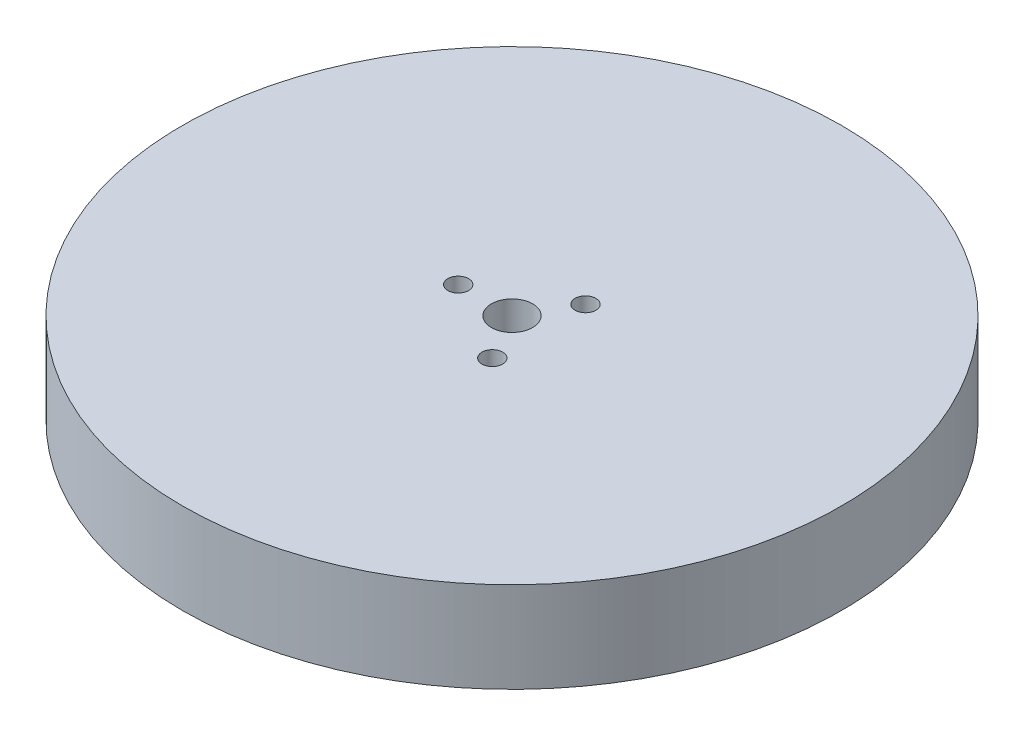
ISO-10303-21;
HEADER;
FILE_DESCRIPTION(('STEP AP214'),'2;1');
FILE_NAME('part.step','',(''),(''),'','','');
FILE_SCHEMA(('AUTOMOTIVE_DESIGN { 1 0 10303 214 1 1 1 1 }'));
ENDSEC;
DATA;
#1=APPLICATION_CONTEXT('core data for automotive mechanical design processes');
#2=APPLICATION_PROTOCOL_DEFINITION('international standard','automotive_design',2000,#1);
#3=PRODUCT_CONTEXT('',#1,'mechanical');
#4=PRODUCT('Part','Part','',(#3));
#5=PRODUCT_RELATED_PRODUCT_CATEGORY('part','',(#4));
#6=PRODUCT_DEFINITION_FORMATION('','',#4);
#7=PRODUCT_DEFINITION_CONTEXT('part definition',#1,'design');
#8=PRODUCT_DEFINITION('design','',#6,#7);
#9=PRODUCT_DEFINITION_SHAPE('','',#8);
#10=(LENGTH_UNIT() NAMED_UNIT(*) SI_UNIT(.MILLI.,.METRE.));
#11=(NAMED_UNIT(*) PLANE_ANGLE_UNIT() SI_UNIT($,.RADIAN.));
#12=(NAMED_UNIT(*) SI_UNIT($,.STERADIAN.) SOLID_ANGLE_UNIT());
#13=UNCERTAINTY_MEASURE_WITH_UNIT(LENGTH_MEASURE(1.E-05),#10,'distance_accuracy_value','');
#14=(GEOMETRIC_REPRESENTATION_CONTEXT(3) GLOBAL_UNCERTAINTY_ASSIGNED_CONTEXT((#13)) GLOBAL_UNIT_ASSIGNED_CONTEXT((#10,
#11,#12)) REPRESENTATION_CONTEXT('',''));
#15=CARTESIAN_POINT('',(0.,0.,0.));
#16=DIRECTION('',(0.,0.,1.));
#17=DIRECTION('',(1.,0.,0.));
#18=AXIS2_PLACEMENT_3D('',#15,#16,#17);
#19=CARTESIAN_POINT('',(0.,22.,0.));
#20=DIRECTION('',(0.,-1.,0.));
#21=DIRECTION('',(0.,0.,-1.));
#22=AXIS2_PLACEMENT_3D('',#19,#20,#21);
#23=CYLINDRICAL_SURFACE('',#22,80.);
#24=CARTESIAN_POINT('',(0.,22.,0.));
#25=DIRECTION('',(0.,1.,0.));
#26=DIRECTION('',(0.,0.,1.));
#27=AXIS2_PLACEMENT_3D('',#24,#25,#26);
#28=CIRCLE('',#27,80.);
#29=CARTESIAN_POINT('',(0.,22.,80.));
#30=VERTEX_POINT('',#29);
#31=EDGE_CURVE('E10',#30,#30,#28,.T.);
#32=ORIENTED_EDGE('',*,*,#31,.F.);
#33=EDGE_LOOP('',(#32));
#34=FACE_BOUND('',#33,.T.);
#35=CARTESIAN_POINT('',(0.,0.,0.));
#36=DIRECTION('',(0.,1.,0.));
#37=DIRECTION('',(0.,0.,1.));
#38=AXIS2_PLACEMENT_3D('',#35,#36,#37);
#39=CIRCLE('',#38,80.);
#40=CARTESIAN_POINT('',(0.,0.,80.));
#41=VERTEX_POINT('',#40);
#42=EDGE_CURVE('E37',#41,#41,#39,.T.);
#43=ORIENTED_EDGE('',*,*,#42,.T.);
#44=EDGE_LOOP('',(#43));
#45=FACE_BOUND('',#44,.T.);
#46=ADVANCED_FACE('F40',(#34,#45),#23,.T.);
#47=CARTESIAN_POINT('',(0.,22.,0.));
#48=DIRECTION('',(0.,1.,0.));
#49=DIRECTION('',(0.,0.,1.));
#50=AXIS2_PLACEMENT_3D('',#47,#48,#49);
#51=PLANE('',#50);
#52=CARTESIAN_POINT('',(6.52944692631327,22.,11.3093338216989));
#53=DIRECTION('',(0.,1.,0.));
#54=DIRECTION('',(0.866025403784436,0.,-0.500000000000004));
#55=AXIS2_PLACEMENT_3D('',#52,#53,#54);
#56=CIRCLE('',#55,2.52004237588757);
#57=CARTESIAN_POINT('',(8.71186764244519,22.,10.0493126337551));
#58=VERTEX_POINT('',#57);
#59=EDGE_CURVE('E70',#58,#58,#56,.T.);
#60=ORIENTED_EDGE('',*,*,#59,.F.);
#61=EDGE_LOOP('',(#60));
#62=FACE_BOUND('',#61,.T.);
#63=CARTESIAN_POINT('',(6.52944692631311,22.,-11.309333821699));
#64=DIRECTION('',(0.,1.,0.));
#65=DIRECTION('',(-0.866025403784443,0.,-0.499999999999992));
#66=AXIS2_PLACEMENT_3D('',#63,#64,#65);
#67=CIRCLE('',#66,2.52004237588757);
#68=CARTESIAN_POINT('',(4.34702621018117,22.,-12.5693550096428));
#69=VERTEX_POINT('',#68);
#70=EDGE_CURVE('E61',#69,#69,#67,.T.);
#71=ORIENTED_EDGE('',*,*,#70,.F.);
#72=EDGE_LOOP('',(#71));
#73=FACE_BOUND('',#72,.T.);
#74=CARTESIAN_POINT('',(-13.0588938526264,22.,0.));
#75=DIRECTION('',(0.,1.,0.));
#76=DIRECTION('',(0.,0.,1.));
#77=AXIS2_PLACEMENT_3D('',#74,#75,#76);
#78=CIRCLE('',#77,2.52004237588757);
#79=CARTESIAN_POINT('',(-13.0588938526264,22.,2.52004237588757));
#80=VERTEX_POINT('',#79);
#81=EDGE_CURVE('E54',#80,#80,#78,.T.);
#82=ORIENTED_EDGE('',*,*,#81,.F.);
#83=EDGE_LOOP('',(#82));
#84=FACE_BOUND('',#83,.T.);
#85=CARTESIAN_POINT('',(0.,22.,0.));
#86=DIRECTION('',(0.,1.,0.));
#87=DIRECTION('',(0.,0.,1.));
#88=AXIS2_PLACEMENT_3D('',#85,#86,#87);
#89=CIRCLE('',#88,5.);
#90=CARTESIAN_POINT('',(0.,22.,5.));
#91=VERTEX_POINT('',#90);
#92=EDGE_CURVE('E50',#91,#91,#89,.T.);
#93=ORIENTED_EDGE('',*,*,#92,.F.);
#94=EDGE_LOOP('',(#93));
#95=FACE_BOUND('',#94,.T.);
#96=ORIENTED_EDGE('',*,*,#31,.T.);
#97=EDGE_LOOP('',(#96));
#98=FACE_BOUND('',#97,.T.);
#99=ADVANCED_FACE('F85',(#62,#73,#84,#95,#98),#51,.T.);
#100=CARTESIAN_POINT('',(0.,0.,0.));
#101=DIRECTION('',(0.,1.,0.));
#102=DIRECTION('',(0.,0.,1.));
#103=AXIS2_PLACEMENT_3D('',#100,#101,#102);
#104=PLANE('',#103);
#105=CARTESIAN_POINT('',(0.,0.,0.));
#106=DIRECTION('',(0.,1.,0.));
#107=DIRECTION('',(0.,0.,1.));
#108=AXIS2_PLACEMENT_3D('',#105,#106,#107);
#109=CIRCLE('',#108,5.);
#110=CARTESIAN_POINT('',(0.,0.,5.));
#111=VERTEX_POINT('',#110);
#112=EDGE_CURVE('E47',#111,#111,#109,.T.);
#113=ORIENTED_EDGE('',*,*,#112,.T.);
#114=EDGE_LOOP('',(#113));
#115=FACE_BOUND('',#114,.T.);
#116=ORIENTED_EDGE('',*,*,#42,.F.);
#117=EDGE_LOOP('',(#116));
#118=FACE_BOUND('',#117,.T.);
#119=ADVANCED_FACE('F84',(#115,#118),#104,.F.);
#120=CARTESIAN_POINT('',(0.,22.,0.));
#121=DIRECTION('',(0.,-1.,0.));
#122=DIRECTION('',(0.,0.,-1.));
#123=AXIS2_PLACEMENT_3D('',#120,#121,#122);
#124=CYLINDRICAL_SURFACE('',#123,5.);
#125=ORIENTED_EDGE('',*,*,#92,.T.);
#126=EDGE_LOOP('',(#125));
#127=FACE_BOUND('',#126,.T.);
#128=ORIENTED_EDGE('',*,*,#112,.F.);
#129=EDGE_LOOP('',(#128));
#130=FACE_BOUND('',#129,.T.);
#131=ADVANCED_FACE('F91',(#127,#130),#124,.F.);
#132=CARTESIAN_POINT('',(-13.0588938526264,4.92523036009052,0.));
#133=DIRECTION('',(0.,1.,0.));
#134=DIRECTION('',(0.,0.,1.));
#135=AXIS2_PLACEMENT_3D('',#132,#133,#134);
#136=CYLINDRICAL_SURFACE('',#135,2.52004237588757);
#137=CARTESIAN_POINT('',(-13.0588938526264,4.92523036009052,0.));
#138=DIRECTION('',(0.,1.,0.));
#139=DIRECTION('',(0.,0.,1.));
#140=AXIS2_PLACEMENT_3D('',#137,#138,#139);
#141=CIRCLE('',#140,2.52004237588757);
#142=CARTESIAN_POINT('',(-13.0588938526264,4.92523036009052,2.52004237588757));
#143=VERTEX_POINT('',#142);
#144=EDGE_CURVE('E55',#143,#143,#141,.T.);
#145=ORIENTED_EDGE('',*,*,#144,.F.);
#146=EDGE_LOOP('',(#145));
#147=FACE_BOUND('',#146,.T.);
#148=ORIENTED_EDGE('',*,*,#81,.T.);
#149=EDGE_LOOP('',(#148));
#150=FACE_BOUND('',#149,.T.);
#151=ADVANCED_FACE('F96',(#147,#150),#136,.F.);
#152=CARTESIAN_POINT('',(-13.0588938526264,4.92523036009052,0.));
#153=DIRECTION('',(0.,1.,0.));
#154=DIRECTION('',(0.,0.,1.));
#155=AXIS2_PLACEMENT_3D('',#152,#153,#154);
#156=PLANE('',#155);
#157=ORIENTED_EDGE('',*,*,#144,.T.);
#158=EDGE_LOOP('',(#157));
#159=FACE_BOUND('',#158,.T.);
#160=ADVANCED_FACE('F127',(#159),#156,.T.);
#161=CARTESIAN_POINT('',(6.52944692631311,4.92523036009052,-11.309333821699));
#162=DIRECTION('',(0.,1.,0.));
#163=DIRECTION('',(0.,0.,1.));
#164=AXIS2_PLACEMENT_3D('',#161,#162,#163);
#165=CYLINDRICAL_SURFACE('',#164,2.52004237588757);
#166=CARTESIAN_POINT('',(6.52944692631311,4.92523036009052,-11.309333821699));
#167=DIRECTION('',(0.,1.,0.));
#168=DIRECTION('',(-0.866025403784443,0.,-0.499999999999992));
#169=AXIS2_PLACEMENT_3D('',#166,#167,#168);
#170=CIRCLE('',#169,2.52004237588757);
#171=CARTESIAN_POINT('',(4.34702621018117,4.92523036009052,-12.5693550096428));
#172=VERTEX_POINT('',#171);
#173=EDGE_CURVE('E63',#172,#172,#170,.T.);
#174=ORIENTED_EDGE('',*,*,#173,.F.);
#175=EDGE_LOOP('',(#174));
#176=FACE_BOUND('',#175,.T.);
#177=ORIENTED_EDGE('',*,*,#70,.T.);
#178=EDGE_LOOP('',(#177));
#179=FACE_BOUND('',#178,.T.);
#180=ADVANCED_FACE('F133',(#176,#179),#165,.F.);
#181=CARTESIAN_POINT('',(6.52944692631311,4.92523036009052,-11.309333821699));
#182=DIRECTION('',(0.,1.,0.));
#183=DIRECTION('',(-0.866025403784443,0.,-0.499999999999992));
#184=AXIS2_PLACEMENT_3D('',#181,#182,#183);
#185=PLANE('',#184);
#186=ORIENTED_EDGE('',*,*,#173,.T.);
#187=EDGE_LOOP('',(#186));
#188=FACE_BOUND('',#187,.T.);
#189=ADVANCED_FACE('F77',(#188),#185,.T.);
#190=CARTESIAN_POINT('',(6.52944692631327,4.92523036009052,11.3093338216989));
#191=DIRECTION('',(0.,1.,0.));
#192=DIRECTION('',(0.,0.,1.));
#193=AXIS2_PLACEMENT_3D('',#190,#191,#192);
#194=CYLINDRICAL_SURFACE('',#193,2.52004237588757);
#195=CARTESIAN_POINT('',(6.52944692631327,4.92523036009052,11.3093338216989));
#196=DIRECTION('',(0.,1.,0.));
#197=DIRECTION('',(0.866025403784436,0.,-0.500000000000004));
#198=AXIS2_PLACEMENT_3D('',#195,#196,#197);
#199=CIRCLE('',#198,2.52004237588757);
#200=CARTESIAN_POINT('',(8.71186764244519,4.92523036009052,10.0493126337551));
#201=VERTEX_POINT('',#200);
#202=EDGE_CURVE('E59',#201,#201,#199,.T.);
#203=ORIENTED_EDGE('',*,*,#202,.F.);
#204=EDGE_LOOP('',(#203));
#205=FACE_BOUND('',#204,.T.);
#206=ORIENTED_EDGE('',*,*,#59,.T.);
#207=EDGE_LOOP('',(#206));
#208=FACE_BOUND('',#207,.T.);
#209=ADVANCED_FACE('F73',(#205,#208),#194,.F.);
#210=CARTESIAN_POINT('',(6.52944692631327,4.92523036009052,11.3093338216989));
#211=DIRECTION('',(0.,1.,0.));
#212=DIRECTION('',(0.866025403784436,0.,-0.500000000000004));
#213=AXIS2_PLACEMENT_3D('',#210,#211,#212);
#214=PLANE('',#213);
#215=ORIENTED_EDGE('',*,*,#202,.T.);
#216=EDGE_LOOP('',(#215));
#217=FACE_BOUND('',#216,.T.);
#218=ADVANCED_FACE('F71',(#217),#214,.T.);
#219=CLOSED_SHELL('',(#46,#99,#119,#131,#151,#160,#180,#189,#209,#218));
#220=MANIFOLD_SOLID_BREP('B2',#219);
#221=ADVANCED_BREP_SHAPE_REPRESENTATION('',(#18,#220),#14);
#222=SHAPE_DEFINITION_REPRESENTATION(#9,#221);
ENDSEC;
END-ISO-10303-21;
